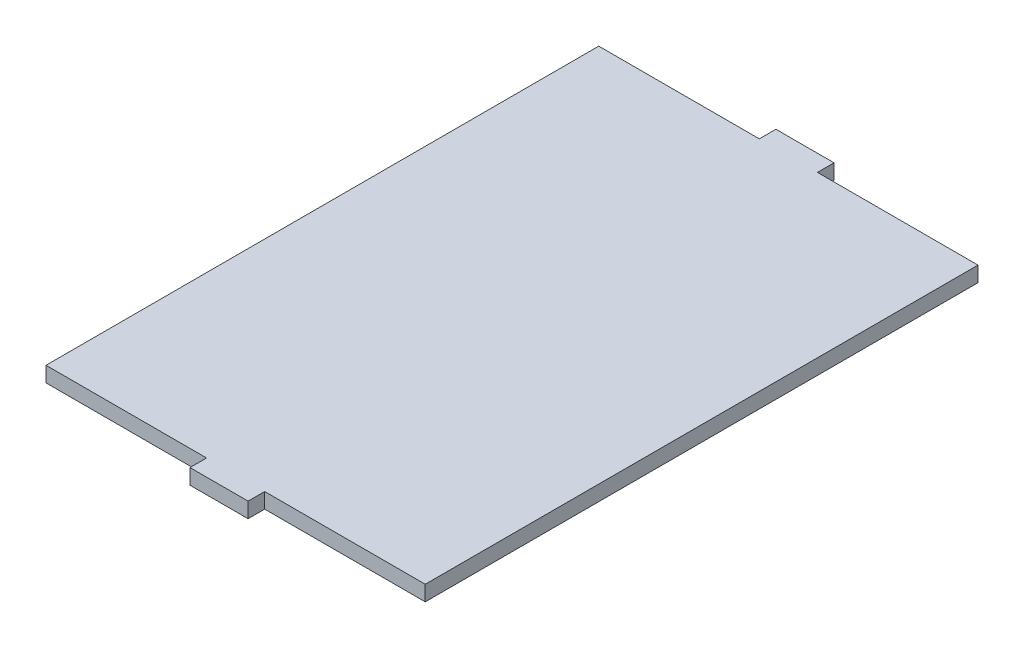
ISO-10303-21;
HEADER;
FILE_DESCRIPTION(('STEP AP214'),'2;1');
FILE_NAME('part.step','',(''),(''),'','','');
FILE_SCHEMA(('AUTOMOTIVE_DESIGN { 1 0 10303 214 1 1 1 1 }'));
ENDSEC;
DATA;
#1=APPLICATION_CONTEXT('core data for automotive mechanical design processes');
#2=APPLICATION_PROTOCOL_DEFINITION('international standard','automotive_design',2000,#1);
#3=PRODUCT_CONTEXT('',#1,'mechanical');
#4=PRODUCT('Part','Part','',(#3));
#5=PRODUCT_RELATED_PRODUCT_CATEGORY('part','',(#4));
#6=PRODUCT_DEFINITION_FORMATION('','',#4);
#7=PRODUCT_DEFINITION_CONTEXT('part definition',#1,'design');
#8=PRODUCT_DEFINITION('design','',#6,#7);
#9=PRODUCT_DEFINITION_SHAPE('','',#8);
#10=(LENGTH_UNIT() NAMED_UNIT(*) SI_UNIT(.MILLI.,.METRE.));
#11=(NAMED_UNIT(*) PLANE_ANGLE_UNIT() SI_UNIT($,.RADIAN.));
#12=(NAMED_UNIT(*) SI_UNIT($,.STERADIAN.) SOLID_ANGLE_UNIT());
#13=UNCERTAINTY_MEASURE_WITH_UNIT(LENGTH_MEASURE(1.E-05),#10,'distance_accuracy_value','');
#14=(GEOMETRIC_REPRESENTATION_CONTEXT(3) GLOBAL_UNCERTAINTY_ASSIGNED_CONTEXT((#13)) GLOBAL_UNIT_ASSIGNED_CONTEXT((#10,
#11,#12)) REPRESENTATION_CONTEXT('',''));
#15=CARTESIAN_POINT('',(0.,0.,0.));
#16=DIRECTION('',(0.,0.,1.));
#17=DIRECTION('',(1.,0.,0.));
#18=AXIS2_PLACEMENT_3D('',#15,#16,#17);
#19=CARTESIAN_POINT('',(0.,0.092,0.));
#20=DIRECTION('',(0.,1.,0.));
#21=DIRECTION('',(0.,0.,1.));
#22=AXIS2_PLACEMENT_3D('',#19,#20,#21);
#23=PLANE('',#22);
#24=DIRECTION('',(0.,0.,1.));
#25=VECTOR('',#24,1.);
#26=CARTESIAN_POINT('',(0.175,0.092,1.6645));
#27=LINE('',#26,#25);
#28=CARTESIAN_POINT('',(0.175,0.092,1.7645));
#29=VERTEX_POINT('',#28);
#30=CARTESIAN_POINT('',(0.175,0.092,1.6645));
#31=VERTEX_POINT('',#30);
#32=EDGE_CURVE('E130',#29,#31,#27,.F.);
#33=ORIENTED_EDGE('',*,*,#32,.T.);
#34=DIRECTION('',(1.,0.,0.));
#35=VECTOR('',#34,1.);
#36=CARTESIAN_POINT('',(-1.142,0.092,1.6645));
#37=LINE('',#36,#35);
#38=CARTESIAN_POINT('',(1.142,0.092,1.6645));
#39=VERTEX_POINT('',#38);
#40=EDGE_CURVE('E132',#39,#31,#37,.F.);
#41=ORIENTED_EDGE('',*,*,#40,.F.);
#42=DIRECTION('',(0.,0.,-1.));
#43=VECTOR('',#42,1.);
#44=CARTESIAN_POINT('',(1.142,0.092,1.6645));
#45=LINE('',#44,#43);
#46=CARTESIAN_POINT('',(1.142,0.092,-1.6645));
#47=VERTEX_POINT('',#46);
#48=EDGE_CURVE('E136',#47,#39,#45,.F.);
#49=ORIENTED_EDGE('',*,*,#48,.F.);
#50=DIRECTION('',(-1.,0.,0.));
#51=VECTOR('',#50,1.);
#52=CARTESIAN_POINT('',(1.142,0.092,-1.6645));
#53=LINE('',#52,#51);
#54=CARTESIAN_POINT('',(0.175,0.092,-1.6645));
#55=VERTEX_POINT('',#54);
#56=EDGE_CURVE('E140',#55,#47,#53,.F.);
#57=ORIENTED_EDGE('',*,*,#56,.F.);
#58=DIRECTION('',(0.,0.,-1.));
#59=VECTOR('',#58,1.);
#60=CARTESIAN_POINT('',(0.175,0.092,-1.6645));
#61=LINE('',#60,#59);
#62=CARTESIAN_POINT('',(0.175,0.092,-1.7645));
#63=VERTEX_POINT('',#62);
#64=EDGE_CURVE('E144',#63,#55,#61,.F.);
#65=ORIENTED_EDGE('',*,*,#64,.F.);
#66=DIRECTION('',(-1.,0.,0.));
#67=VECTOR('',#66,1.);
#68=CARTESIAN_POINT('',(0.175,0.092,-1.7645));
#69=LINE('',#68,#67);
#70=CARTESIAN_POINT('',(-0.175,0.092,-1.7645));
#71=VERTEX_POINT('',#70);
#72=EDGE_CURVE('E148',#71,#63,#69,.F.);
#73=ORIENTED_EDGE('',*,*,#72,.F.);
#74=DIRECTION('',(0.,0.,1.));
#75=VECTOR('',#74,1.);
#76=CARTESIAN_POINT('',(-0.175,0.092,-1.7645));
#77=LINE('',#76,#75);
#78=CARTESIAN_POINT('',(-0.175,0.092,-1.6645));
#79=VERTEX_POINT('',#78);
#80=EDGE_CURVE('E152',#79,#71,#77,.F.);
#81=ORIENTED_EDGE('',*,*,#80,.F.);
#82=DIRECTION('',(-1.,0.,0.));
#83=VECTOR('',#82,1.);
#84=CARTESIAN_POINT('',(1.142,0.092,-1.6645));
#85=LINE('',#84,#83);
#86=CARTESIAN_POINT('',(-1.142,0.092,-1.6645));
#87=VERTEX_POINT('',#86);
#88=EDGE_CURVE('E156',#87,#79,#85,.F.);
#89=ORIENTED_EDGE('',*,*,#88,.F.);
#90=DIRECTION('',(0.,0.,1.));
#91=VECTOR('',#90,1.);
#92=CARTESIAN_POINT('',(-1.142,0.092,-1.6645));
#93=LINE('',#92,#91);
#94=CARTESIAN_POINT('',(-1.142,0.092,1.6645));
#95=VERTEX_POINT('',#94);
#96=EDGE_CURVE('E107',#95,#87,#93,.F.);
#97=ORIENTED_EDGE('',*,*,#96,.F.);
#98=DIRECTION('',(1.,0.,0.));
#99=VECTOR('',#98,1.);
#100=CARTESIAN_POINT('',(-1.142,0.092,1.6645));
#101=LINE('',#100,#99);
#102=CARTESIAN_POINT('',(-0.175,0.092,1.6645));
#103=VERTEX_POINT('',#102);
#104=EDGE_CURVE('E20',#103,#95,#101,.F.);
#105=ORIENTED_EDGE('',*,*,#104,.F.);
#106=DIRECTION('',(0.,0.,-1.));
#107=VECTOR('',#106,1.);
#108=CARTESIAN_POINT('',(-0.175,0.092,1.7645));
#109=LINE('',#108,#107);
#110=CARTESIAN_POINT('',(-0.175,0.092,1.7645));
#111=VERTEX_POINT('',#110);
#112=EDGE_CURVE('E102',#103,#111,#109,.F.);
#113=ORIENTED_EDGE('',*,*,#112,.T.);
#114=DIRECTION('',(-1.,0.,0.));
#115=VECTOR('',#114,1.);
#116=CARTESIAN_POINT('',(0.175,0.092,1.7645));
#117=LINE('',#116,#115);
#118=EDGE_CURVE('E125',#111,#29,#117,.F.);
#119=ORIENTED_EDGE('',*,*,#118,.T.);
#120=EDGE_LOOP('',(#33,#41,#49,#57,#65,#73,#81,#89,#97,#105,#113,#119));
#121=FACE_BOUND('',#120,.T.);
#122=ADVANCED_FACE('F17',(#121),#23,.T.);
#123=CARTESIAN_POINT('',(-1.142,0.,1.6645));
#124=DIRECTION('',(0.,0.,1.));
#125=DIRECTION('',(1.,0.,0.));
#126=AXIS2_PLACEMENT_3D('',#123,#124,#125);
#127=PLANE('',#126);
#128=DIRECTION('',(1.,0.,0.));
#129=VECTOR('',#128,1.);
#130=CARTESIAN_POINT('',(0.,0.,1.6645));
#131=LINE('',#130,#129);
#132=CARTESIAN_POINT('',(-1.142,0.,1.6645));
#133=VERTEX_POINT('',#132);
#134=CARTESIAN_POINT('',(-0.175,0.,1.6645));
#135=VERTEX_POINT('',#134);
#136=EDGE_CURVE('E122',#133,#135,#131,.T.);
#137=ORIENTED_EDGE('',*,*,#136,.T.);
#138=DIRECTION('',(0.,1.,0.));
#139=VECTOR('',#138,1.);
#140=CARTESIAN_POINT('',(-0.175,0.,1.6645));
#141=LINE('',#140,#139);
#142=EDGE_CURVE('E112',#135,#103,#141,.T.);
#143=ORIENTED_EDGE('',*,*,#142,.T.);
#144=ORIENTED_EDGE('',*,*,#104,.T.);
#145=DIRECTION('',(0.,1.,0.));
#146=VECTOR('',#145,1.);
#147=CARTESIAN_POINT('',(-1.142,0.,1.6645));
#148=LINE('',#147,#146);
#149=EDGE_CURVE('E160',#133,#95,#148,.T.);
#150=ORIENTED_EDGE('',*,*,#149,.F.);
#151=EDGE_LOOP('',(#137,#143,#144,#150));
#152=FACE_BOUND('',#151,.T.);
#153=ADVANCED_FACE('F121',(#152),#127,.T.);
#154=CARTESIAN_POINT('',(-0.175,0.,1.7645));
#155=DIRECTION('',(1.,0.,0.));
#156=DIRECTION('',(0.,0.,-1.));
#157=AXIS2_PLACEMENT_3D('',#154,#155,#156);
#158=PLANE('',#157);
#159=ORIENTED_EDGE('',*,*,#112,.F.);
#160=ORIENTED_EDGE('',*,*,#142,.F.);
#161=DIRECTION('',(0.,0.,1.));
#162=VECTOR('',#161,1.);
#163=CARTESIAN_POINT('',(-0.175,0.,0.));
#164=LINE('',#163,#162);
#165=CARTESIAN_POINT('',(-0.175,0.,1.7645));
#166=VERTEX_POINT('',#165);
#167=EDGE_CURVE('E165',#135,#166,#164,.T.);
#168=ORIENTED_EDGE('',*,*,#167,.T.);
#169=DIRECTION('',(0.,1.,0.));
#170=VECTOR('',#169,1.);
#171=CARTESIAN_POINT('',(-0.175,0.,1.7645));
#172=LINE('',#171,#170);
#173=EDGE_CURVE('E118',#166,#111,#172,.T.);
#174=ORIENTED_EDGE('',*,*,#173,.T.);
#175=EDGE_LOOP('',(#159,#160,#168,#174));
#176=FACE_BOUND('',#175,.T.);
#177=ADVANCED_FACE('F115',(#176),#158,.F.);
#178=CARTESIAN_POINT('',(0.175,0.,1.7645));
#179=DIRECTION('',(0.,0.,-1.));
#180=DIRECTION('',(-1.,0.,0.));
#181=AXIS2_PLACEMENT_3D('',#178,#179,#180);
#182=PLANE('',#181);
#183=ORIENTED_EDGE('',*,*,#118,.F.);
#184=ORIENTED_EDGE('',*,*,#173,.F.);
#185=DIRECTION('',(1.,0.,0.));
#186=VECTOR('',#185,1.);
#187=CARTESIAN_POINT('',(0.,0.,1.7645));
#188=LINE('',#187,#186);
#189=CARTESIAN_POINT('',(0.175,0.,1.7645));
#190=VERTEX_POINT('',#189);
#191=EDGE_CURVE('E167',#166,#190,#188,.T.);
#192=ORIENTED_EDGE('',*,*,#191,.T.);
#193=DIRECTION('',(0.,1.,0.));
#194=VECTOR('',#193,1.);
#195=CARTESIAN_POINT('',(0.175,0.,1.7645));
#196=LINE('',#195,#194);
#197=EDGE_CURVE('E127',#190,#29,#196,.T.);
#198=ORIENTED_EDGE('',*,*,#197,.T.);
#199=EDGE_LOOP('',(#183,#184,#192,#198));
#200=FACE_BOUND('',#199,.T.);
#201=ADVANCED_FACE('F234',(#200),#182,.F.);
#202=CARTESIAN_POINT('',(0.175,0.,1.6645));
#203=DIRECTION('',(-1.,0.,0.));
#204=DIRECTION('',(0.,0.,1.));
#205=AXIS2_PLACEMENT_3D('',#202,#203,#204);
#206=PLANE('',#205);
#207=ORIENTED_EDGE('',*,*,#32,.F.);
#208=ORIENTED_EDGE('',*,*,#197,.F.);
#209=DIRECTION('',(0.,0.,1.));
#210=VECTOR('',#209,1.);
#211=CARTESIAN_POINT('',(0.175,0.,0.));
#212=LINE('',#211,#210);
#213=CARTESIAN_POINT('',(0.175,0.,1.6645));
#214=VERTEX_POINT('',#213);
#215=EDGE_CURVE('E170',#190,#214,#212,.F.);
#216=ORIENTED_EDGE('',*,*,#215,.T.);
#217=DIRECTION('',(0.,1.,0.));
#218=VECTOR('',#217,1.);
#219=CARTESIAN_POINT('',(0.175,0.,1.6645));
#220=LINE('',#219,#218);
#221=EDGE_CURVE('E134',#31,#214,#220,.F.);
#222=ORIENTED_EDGE('',*,*,#221,.F.);
#223=EDGE_LOOP('',(#207,#208,#216,#222));
#224=FACE_BOUND('',#223,.T.);
#225=ADVANCED_FACE('F232',(#224),#206,.F.);
#226=CARTESIAN_POINT('',(-1.142,0.,1.6645));
#227=DIRECTION('',(0.,0.,1.));
#228=DIRECTION('',(1.,0.,0.));
#229=AXIS2_PLACEMENT_3D('',#226,#227,#228);
#230=PLANE('',#229);
#231=ORIENTED_EDGE('',*,*,#40,.T.);
#232=ORIENTED_EDGE('',*,*,#221,.T.);
#233=DIRECTION('',(1.,0.,0.));
#234=VECTOR('',#233,1.);
#235=CARTESIAN_POINT('',(0.,0.,1.6645));
#236=LINE('',#235,#234);
#237=CARTESIAN_POINT('',(1.142,0.,1.6645));
#238=VERTEX_POINT('',#237);
#239=EDGE_CURVE('E173',#214,#238,#236,.T.);
#240=ORIENTED_EDGE('',*,*,#239,.T.);
#241=DIRECTION('',(0.,1.,0.));
#242=VECTOR('',#241,1.);
#243=CARTESIAN_POINT('',(1.142,0.,1.6645));
#244=LINE('',#243,#242);
#245=EDGE_CURVE('E138',#39,#238,#244,.F.);
#246=ORIENTED_EDGE('',*,*,#245,.F.);
#247=EDGE_LOOP('',(#231,#232,#240,#246));
#248=FACE_BOUND('',#247,.T.);
#249=ADVANCED_FACE('F226',(#248),#230,.T.);
#250=CARTESIAN_POINT('',(1.142,0.,1.6645));
#251=DIRECTION('',(1.,0.,0.));
#252=DIRECTION('',(0.,0.,-1.));
#253=AXIS2_PLACEMENT_3D('',#250,#251,#252);
#254=PLANE('',#253);
#255=ORIENTED_EDGE('',*,*,#245,.T.);
#256=DIRECTION('',(0.,0.,1.));
#257=VECTOR('',#256,1.);
#258=CARTESIAN_POINT('',(1.142,0.,0.));
#259=LINE('',#258,#257);
#260=CARTESIAN_POINT('',(1.142,0.,-1.6645));
#261=VERTEX_POINT('',#260);
#262=EDGE_CURVE('E176',#238,#261,#259,.F.);
#263=ORIENTED_EDGE('',*,*,#262,.T.);
#264=DIRECTION('',(0.,1.,0.));
#265=VECTOR('',#264,1.);
#266=CARTESIAN_POINT('',(1.142,0.,-1.6645));
#267=LINE('',#266,#265);
#268=EDGE_CURVE('E142',#47,#261,#267,.F.);
#269=ORIENTED_EDGE('',*,*,#268,.F.);
#270=ORIENTED_EDGE('',*,*,#48,.T.);
#271=EDGE_LOOP('',(#255,#263,#269,#270));
#272=FACE_BOUND('',#271,.T.);
#273=ADVANCED_FACE('F222',(#272),#254,.T.);
#274=CARTESIAN_POINT('',(1.142,0.,-1.6645));
#275=DIRECTION('',(0.,0.,-1.));
#276=DIRECTION('',(-1.,0.,0.));
#277=AXIS2_PLACEMENT_3D('',#274,#275,#276);
#278=PLANE('',#277);
#279=DIRECTION('',(1.,0.,0.));
#280=VECTOR('',#279,1.);
#281=CARTESIAN_POINT('',(0.,0.,-1.6645));
#282=LINE('',#281,#280);
#283=CARTESIAN_POINT('',(0.175,0.,-1.6645));
#284=VERTEX_POINT('',#283);
#285=EDGE_CURVE('E179',#261,#284,#282,.F.);
#286=ORIENTED_EDGE('',*,*,#285,.T.);
#287=DIRECTION('',(0.,1.,0.));
#288=VECTOR('',#287,1.);
#289=CARTESIAN_POINT('',(0.175,0.,-1.6645));
#290=LINE('',#289,#288);
#291=EDGE_CURVE('E146',#55,#284,#290,.F.);
#292=ORIENTED_EDGE('',*,*,#291,.F.);
#293=ORIENTED_EDGE('',*,*,#56,.T.);
#294=ORIENTED_EDGE('',*,*,#268,.T.);
#295=EDGE_LOOP('',(#286,#292,#293,#294));
#296=FACE_BOUND('',#295,.T.);
#297=ADVANCED_FACE('F216',(#296),#278,.T.);
#298=CARTESIAN_POINT('',(0.175,0.,-1.6645));
#299=DIRECTION('',(1.,0.,0.));
#300=DIRECTION('',(0.,0.,-1.));
#301=AXIS2_PLACEMENT_3D('',#298,#299,#300);
#302=PLANE('',#301);
#303=ORIENTED_EDGE('',*,*,#64,.T.);
#304=ORIENTED_EDGE('',*,*,#291,.T.);
#305=DIRECTION('',(0.,0.,1.));
#306=VECTOR('',#305,1.);
#307=CARTESIAN_POINT('',(0.175,0.,0.));
#308=LINE('',#307,#306);
#309=CARTESIAN_POINT('',(0.175,0.,-1.7645));
#310=VERTEX_POINT('',#309);
#311=EDGE_CURVE('E182',#284,#310,#308,.F.);
#312=ORIENTED_EDGE('',*,*,#311,.T.);
#313=DIRECTION('',(0.,1.,0.));
#314=VECTOR('',#313,1.);
#315=CARTESIAN_POINT('',(0.175,0.,-1.7645));
#316=LINE('',#315,#314);
#317=EDGE_CURVE('E150',#63,#310,#316,.F.);
#318=ORIENTED_EDGE('',*,*,#317,.F.);
#319=EDGE_LOOP('',(#303,#304,#312,#318));
#320=FACE_BOUND('',#319,.T.);
#321=ADVANCED_FACE('F212',(#320),#302,.T.);
#322=CARTESIAN_POINT('',(0.175,0.,-1.7645));
#323=DIRECTION('',(0.,0.,-1.));
#324=DIRECTION('',(-1.,0.,0.));
#325=AXIS2_PLACEMENT_3D('',#322,#323,#324);
#326=PLANE('',#325);
#327=ORIENTED_EDGE('',*,*,#317,.T.);
#328=DIRECTION('',(1.,0.,0.));
#329=VECTOR('',#328,1.);
#330=CARTESIAN_POINT('',(0.,0.,-1.7645));
#331=LINE('',#330,#329);
#332=CARTESIAN_POINT('',(-0.175,0.,-1.7645));
#333=VERTEX_POINT('',#332);
#334=EDGE_CURVE('E185',#310,#333,#331,.F.);
#335=ORIENTED_EDGE('',*,*,#334,.T.);
#336=DIRECTION('',(0.,1.,0.));
#337=VECTOR('',#336,1.);
#338=CARTESIAN_POINT('',(-0.175,0.,-1.7645));
#339=LINE('',#338,#337);
#340=EDGE_CURVE('E154',#71,#333,#339,.F.);
#341=ORIENTED_EDGE('',*,*,#340,.F.);
#342=ORIENTED_EDGE('',*,*,#72,.T.);
#343=EDGE_LOOP('',(#327,#335,#341,#342));
#344=FACE_BOUND('',#343,.T.);
#345=ADVANCED_FACE('F206',(#344),#326,.T.);
#346=CARTESIAN_POINT('',(-0.175,0.,-1.7645));
#347=DIRECTION('',(-1.,0.,0.));
#348=DIRECTION('',(0.,0.,1.));
#349=AXIS2_PLACEMENT_3D('',#346,#347,#348);
#350=PLANE('',#349);
#351=DIRECTION('',(0.,0.,1.));
#352=VECTOR('',#351,1.);
#353=CARTESIAN_POINT('',(-0.175,0.,0.));
#354=LINE('',#353,#352);
#355=CARTESIAN_POINT('',(-0.175,0.,-1.6645));
#356=VERTEX_POINT('',#355);
#357=EDGE_CURVE('E188',#333,#356,#354,.T.);
#358=ORIENTED_EDGE('',*,*,#357,.T.);
#359=DIRECTION('',(0.,1.,0.));
#360=VECTOR('',#359,1.);
#361=CARTESIAN_POINT('',(-0.175,0.,-1.6645));
#362=LINE('',#361,#360);
#363=EDGE_CURVE('E158',#79,#356,#362,.F.);
#364=ORIENTED_EDGE('',*,*,#363,.F.);
#365=ORIENTED_EDGE('',*,*,#80,.T.);
#366=ORIENTED_EDGE('',*,*,#340,.T.);
#367=EDGE_LOOP('',(#358,#364,#365,#366));
#368=FACE_BOUND('',#367,.T.);
#369=ADVANCED_FACE('F201',(#368),#350,.T.);
#370=CARTESIAN_POINT('',(1.142,0.,-1.6645));
#371=DIRECTION('',(0.,0.,-1.));
#372=DIRECTION('',(-1.,0.,0.));
#373=AXIS2_PLACEMENT_3D('',#370,#371,#372);
#374=PLANE('',#373);
#375=ORIENTED_EDGE('',*,*,#88,.T.);
#376=ORIENTED_EDGE('',*,*,#363,.T.);
#377=DIRECTION('',(1.,0.,0.));
#378=VECTOR('',#377,1.);
#379=CARTESIAN_POINT('',(0.,0.,-1.6645));
#380=LINE('',#379,#378);
#381=CARTESIAN_POINT('',(-1.142,0.,-1.6645));
#382=VERTEX_POINT('',#381);
#383=EDGE_CURVE('E26',#356,#382,#380,.F.);
#384=ORIENTED_EDGE('',*,*,#383,.T.);
#385=DIRECTION('',(0.,1.,0.));
#386=VECTOR('',#385,1.);
#387=CARTESIAN_POINT('',(-1.142,0.,-1.6645));
#388=LINE('',#387,#386);
#389=EDGE_CURVE('E34',#87,#382,#388,.F.);
#390=ORIENTED_EDGE('',*,*,#389,.F.);
#391=EDGE_LOOP('',(#375,#376,#384,#390));
#392=FACE_BOUND('',#391,.T.);
#393=ADVANCED_FACE('F194',(#392),#374,.T.);
#394=CARTESIAN_POINT('',(-1.142,0.,-1.6645));
#395=DIRECTION('',(-1.,0.,0.));
#396=DIRECTION('',(0.,0.,1.));
#397=AXIS2_PLACEMENT_3D('',#394,#395,#396);
#398=PLANE('',#397);
#399=ORIENTED_EDGE('',*,*,#389,.T.);
#400=DIRECTION('',(0.,0.,1.));
#401=VECTOR('',#400,1.);
#402=CARTESIAN_POINT('',(-1.142,0.,0.));
#403=LINE('',#402,#401);
#404=EDGE_CURVE('E11',#382,#133,#403,.T.);
#405=ORIENTED_EDGE('',*,*,#404,.T.);
#406=ORIENTED_EDGE('',*,*,#149,.T.);
#407=ORIENTED_EDGE('',*,*,#96,.T.);
#408=EDGE_LOOP('',(#399,#405,#406,#407));
#409=FACE_BOUND('',#408,.T.);
#410=ADVANCED_FACE('F235',(#409),#398,.T.);
#411=CARTESIAN_POINT('',(0.,0.,0.));
#412=DIRECTION('',(0.,1.,0.));
#413=DIRECTION('',(0.,0.,1.));
#414=AXIS2_PLACEMENT_3D('',#411,#412,#413);
#415=PLANE('',#414);
#416=ORIENTED_EDGE('',*,*,#383,.F.);
#417=ORIENTED_EDGE('',*,*,#357,.F.);
#418=ORIENTED_EDGE('',*,*,#334,.F.);
#419=ORIENTED_EDGE('',*,*,#311,.F.);
#420=ORIENTED_EDGE('',*,*,#285,.F.);
#421=ORIENTED_EDGE('',*,*,#262,.F.);
#422=ORIENTED_EDGE('',*,*,#239,.F.);
#423=ORIENTED_EDGE('',*,*,#215,.F.);
#424=ORIENTED_EDGE('',*,*,#191,.F.);
#425=ORIENTED_EDGE('',*,*,#167,.F.);
#426=ORIENTED_EDGE('',*,*,#136,.F.);
#427=ORIENTED_EDGE('',*,*,#404,.F.);
#428=EDGE_LOOP('',(#416,#417,#418,#419,#420,#421,#422,#423,#424,#425,#426,#427));
#429=FACE_BOUND('',#428,.T.);
#430=ADVANCED_FACE('F198',(#429),#415,.F.);
#431=CLOSED_SHELL('',(#122,#153,#177,#201,#225,#249,#273,#297,#321,#345,#369,#393,#410,#430));
#432=MANIFOLD_SOLID_BREP('B1',#431);
#433=ADVANCED_BREP_SHAPE_REPRESENTATION('',(#18,#432),#14);
#434=SHAPE_DEFINITION_REPRESENTATION(#9,#433);
ENDSEC;
END-ISO-10303-21;
